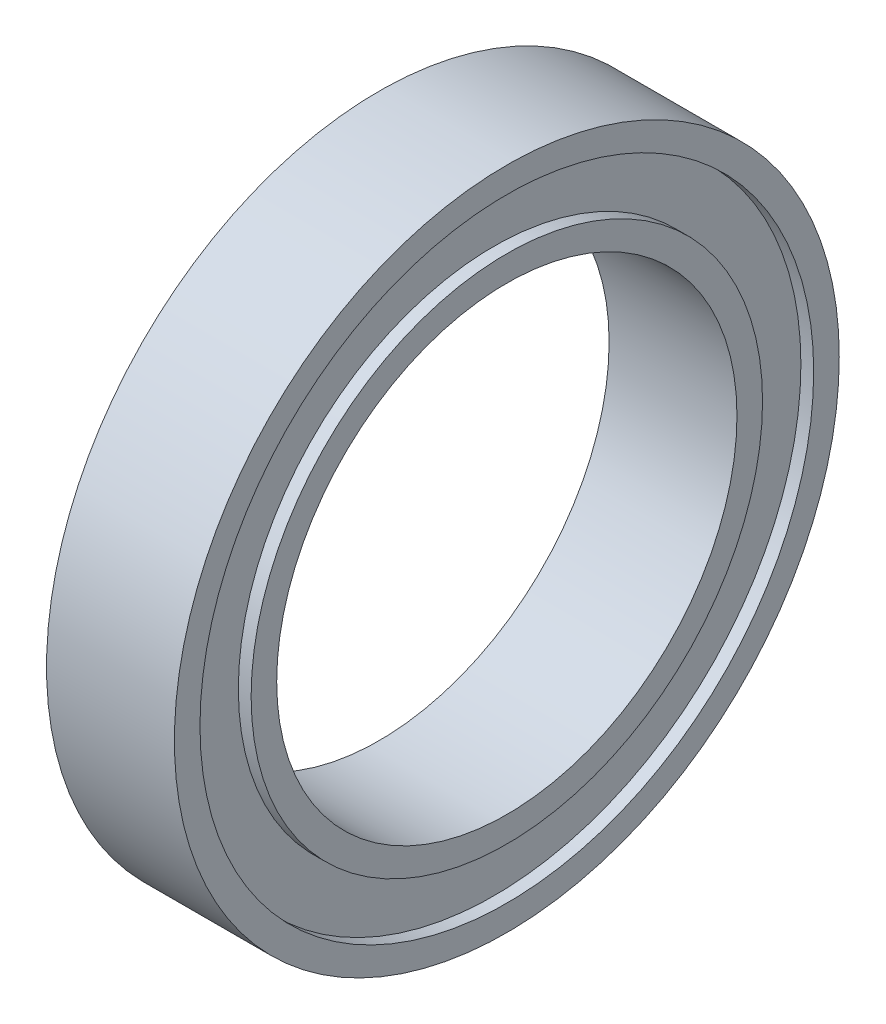
ISO-10303-21;
HEADER;
FILE_DESCRIPTION(('STEP AP214'),'2;1');
FILE_NAME('part.step','',(''),(''),'','','');
FILE_SCHEMA(('AUTOMOTIVE_DESIGN { 1 0 10303 214 1 1 1 1 }'));
ENDSEC;
DATA;
#1=APPLICATION_CONTEXT('core data for automotive mechanical design processes');
#2=APPLICATION_PROTOCOL_DEFINITION('international standard','automotive_design',2000,#1);
#3=PRODUCT_CONTEXT('',#1,'mechanical');
#4=PRODUCT('Part','Part','',(#3));
#5=PRODUCT_RELATED_PRODUCT_CATEGORY('part','',(#4));
#6=PRODUCT_DEFINITION_FORMATION('','',#4);
#7=PRODUCT_DEFINITION_CONTEXT('part definition',#1,'design');
#8=PRODUCT_DEFINITION('design','',#6,#7);
#9=PRODUCT_DEFINITION_SHAPE('','',#8);
#10=(LENGTH_UNIT() NAMED_UNIT(*) SI_UNIT(.MILLI.,.METRE.));
#11=(NAMED_UNIT(*) PLANE_ANGLE_UNIT() SI_UNIT($,.RADIAN.));
#12=(NAMED_UNIT(*) SI_UNIT($,.STERADIAN.) SOLID_ANGLE_UNIT());
#13=UNCERTAINTY_MEASURE_WITH_UNIT(LENGTH_MEASURE(1.E-05),#10,'distance_accuracy_value','');
#14=(GEOMETRIC_REPRESENTATION_CONTEXT(3) GLOBAL_UNCERTAINTY_ASSIGNED_CONTEXT((#13)) GLOBAL_UNIT_ASSIGNED_CONTEXT((#10,
#11,#12)) REPRESENTATION_CONTEXT('',''));
#15=CARTESIAN_POINT('',(0.,0.,0.));
#16=DIRECTION('',(0.,0.,1.));
#17=DIRECTION('',(1.,0.,0.));
#18=AXIS2_PLACEMENT_3D('',#15,#16,#17);
#19=CARTESIAN_POINT('',(-2.5,0.,0.));
#20=DIRECTION('',(1.,0.,0.));
#21=DIRECTION('',(0.,0.,-1.));
#22=AXIS2_PLACEMENT_3D('',#19,#20,#21);
#23=PLANE('',#22);
#24=CARTESIAN_POINT('',(-2.5,0.,0.));
#25=DIRECTION('',(1.,0.,0.));
#26=DIRECTION('',(0.,0.,-1.));
#27=AXIS2_PLACEMENT_3D('',#24,#25,#26);
#28=CIRCLE('',#27,9.);
#29=CARTESIAN_POINT('',(-2.5,0.,-9.));
#30=VERTEX_POINT('',#29);
#31=EDGE_CURVE('E37',#30,#30,#28,.T.);
#32=ORIENTED_EDGE('',*,*,#31,.T.);
#33=EDGE_LOOP('',(#32));
#34=FACE_BOUND('',#33,.T.);
#35=CARTESIAN_POINT('',(-2.5,0.,0.));
#36=DIRECTION('',(1.,0.,0.));
#37=DIRECTION('',(0.,0.,-1.));
#38=AXIS2_PLACEMENT_3D('',#35,#36,#37);
#39=CIRCLE('',#38,10.);
#40=CARTESIAN_POINT('',(-2.5,0.,-10.));
#41=VERTEX_POINT('',#40);
#42=EDGE_CURVE('E67',#41,#41,#39,.T.);
#43=ORIENTED_EDGE('',*,*,#42,.F.);
#44=EDGE_LOOP('',(#43));
#45=FACE_BOUND('',#44,.T.);
#46=ADVANCED_FACE('F33',(#34,#45),#23,.F.);
#47=CARTESIAN_POINT('',(2.5,0.,0.));
#48=DIRECTION('',(1.,0.,0.));
#49=DIRECTION('',(0.,0.,-1.));
#50=AXIS2_PLACEMENT_3D('',#47,#48,#49);
#51=PLANE('',#50);
#52=CARTESIAN_POINT('',(2.5,0.,0.));
#53=DIRECTION('',(1.,0.,0.));
#54=DIRECTION('',(0.,0.,-1.));
#55=AXIS2_PLACEMENT_3D('',#52,#53,#54);
#56=CIRCLE('',#55,9.);
#57=CARTESIAN_POINT('',(2.5,0.,-9.));
#58=VERTEX_POINT('',#57);
#59=EDGE_CURVE('E47',#58,#58,#56,.T.);
#60=ORIENTED_EDGE('',*,*,#59,.F.);
#61=EDGE_LOOP('',(#60));
#62=FACE_BOUND('',#61,.T.);
#63=CARTESIAN_POINT('',(2.5,0.,0.));
#64=DIRECTION('',(1.,0.,0.));
#65=DIRECTION('',(0.,0.,-1.));
#66=AXIS2_PLACEMENT_3D('',#63,#64,#65);
#67=CIRCLE('',#66,10.);
#68=CARTESIAN_POINT('',(2.5,0.,-10.));
#69=VERTEX_POINT('',#68);
#70=EDGE_CURVE('E55',#69,#69,#67,.T.);
#71=ORIENTED_EDGE('',*,*,#70,.T.);
#72=EDGE_LOOP('',(#71));
#73=FACE_BOUND('',#72,.T.);
#74=ADVANCED_FACE('F87',(#62,#73),#51,.T.);
#75=CARTESIAN_POINT('',(2.5,0.,0.));
#76=DIRECTION('',(-1.,0.,0.));
#77=DIRECTION('',(0.,0.,1.));
#78=AXIS2_PLACEMENT_3D('',#75,#76,#77);
#79=CYLINDRICAL_SURFACE('',#78,13.);
#80=CARTESIAN_POINT('',(2.5,0.,0.));
#81=DIRECTION('',(1.,0.,0.));
#82=DIRECTION('',(0.,0.,-1.));
#83=AXIS2_PLACEMENT_3D('',#80,#81,#82);
#84=CIRCLE('',#83,13.);
#85=CARTESIAN_POINT('',(2.5,0.,-13.));
#86=VERTEX_POINT('',#85);
#87=EDGE_CURVE('E10',#86,#86,#84,.T.);
#88=ORIENTED_EDGE('',*,*,#87,.F.);
#89=EDGE_LOOP('',(#88));
#90=FACE_BOUND('',#89,.T.);
#91=CARTESIAN_POINT('',(-2.5,0.,0.));
#92=DIRECTION('',(1.,0.,0.));
#93=DIRECTION('',(0.,0.,-1.));
#94=AXIS2_PLACEMENT_3D('',#91,#92,#93);
#95=CIRCLE('',#94,13.);
#96=CARTESIAN_POINT('',(-2.5,0.,-13.));
#97=VERTEX_POINT('',#96);
#98=EDGE_CURVE('E41',#97,#97,#95,.T.);
#99=ORIENTED_EDGE('',*,*,#98,.T.);
#100=EDGE_LOOP('',(#99));
#101=FACE_BOUND('',#100,.T.);
#102=ADVANCED_FACE('F35',(#90,#101),#79,.T.);
#103=CARTESIAN_POINT('',(2.5,0.,0.));
#104=DIRECTION('',(1.,0.,0.));
#105=DIRECTION('',(0.,0.,-1.));
#106=AXIS2_PLACEMENT_3D('',#103,#104,#105);
#107=CIRCLE('',#106,12.);
#108=CARTESIAN_POINT('',(2.5,0.,-12.));
#109=VERTEX_POINT('',#108);
#110=EDGE_CURVE('E51',#109,#109,#107,.T.);
#111=ORIENTED_EDGE('',*,*,#110,.F.);
#112=EDGE_LOOP('',(#111));
#113=FACE_BOUND('',#112,.T.);
#114=ORIENTED_EDGE('',*,*,#87,.T.);
#115=EDGE_LOOP('',(#114));
#116=FACE_BOUND('',#115,.T.);
#117=ADVANCED_FACE('F95',(#113,#116),#51,.T.);
#118=CARTESIAN_POINT('',(-2.5,0.,0.));
#119=DIRECTION('',(1.,0.,0.));
#120=DIRECTION('',(0.,0.,-1.));
#121=AXIS2_PLACEMENT_3D('',#118,#119,#120);
#122=CIRCLE('',#121,12.);
#123=CARTESIAN_POINT('',(-2.5,0.,-12.));
#124=VERTEX_POINT('',#123);
#125=EDGE_CURVE('E63',#124,#124,#122,.T.);
#126=ORIENTED_EDGE('',*,*,#125,.T.);
#127=EDGE_LOOP('',(#126));
#128=FACE_BOUND('',#127,.T.);
#129=ORIENTED_EDGE('',*,*,#98,.F.);
#130=EDGE_LOOP('',(#129));
#131=FACE_BOUND('',#130,.T.);
#132=ADVANCED_FACE('F89',(#128,#131),#23,.F.);
#133=CARTESIAN_POINT('',(-3.5,0.,0.));
#134=DIRECTION('',(1.,0.,0.));
#135=DIRECTION('',(0.,0.,-1.));
#136=AXIS2_PLACEMENT_3D('',#133,#134,#135);
#137=CYLINDRICAL_SURFACE('',#136,9.);
#138=ORIENTED_EDGE('',*,*,#59,.T.);
#139=EDGE_LOOP('',(#138));
#140=FACE_BOUND('',#139,.T.);
#141=ORIENTED_EDGE('',*,*,#31,.F.);
#142=EDGE_LOOP('',(#141));
#143=FACE_BOUND('',#142,.T.);
#144=ADVANCED_FACE('F98',(#140,#143),#137,.F.);
#145=CARTESIAN_POINT('',(2.,0.,0.));
#146=DIRECTION('',(1.,0.,0.));
#147=DIRECTION('',(0.,0.,-1.));
#148=AXIS2_PLACEMENT_3D('',#145,#146,#147);
#149=CYLINDRICAL_SURFACE('',#148,10.);
#150=CARTESIAN_POINT('',(2.,0.,0.));
#151=DIRECTION('',(1.,0.,0.));
#152=DIRECTION('',(0.,0.,-1.));
#153=AXIS2_PLACEMENT_3D('',#150,#151,#152);
#154=CIRCLE('',#153,10.);
#155=CARTESIAN_POINT('',(2.,0.,-10.));
#156=VERTEX_POINT('',#155);
#157=EDGE_CURVE('E54',#156,#156,#154,.T.);
#158=ORIENTED_EDGE('',*,*,#157,.T.);
#159=EDGE_LOOP('',(#158));
#160=FACE_BOUND('',#159,.T.);
#161=ORIENTED_EDGE('',*,*,#70,.F.);
#162=EDGE_LOOP('',(#161));
#163=FACE_BOUND('',#162,.T.);
#164=ADVANCED_FACE('F104',(#160,#163),#149,.T.);
#165=CARTESIAN_POINT('',(2.,0.,0.));
#166=DIRECTION('',(1.,0.,0.));
#167=DIRECTION('',(0.,0.,-1.));
#168=AXIS2_PLACEMENT_3D('',#165,#166,#167);
#169=CYLINDRICAL_SURFACE('',#168,12.);
#170=CARTESIAN_POINT('',(2.,0.,0.));
#171=DIRECTION('',(1.,0.,0.));
#172=DIRECTION('',(0.,0.,-1.));
#173=AXIS2_PLACEMENT_3D('',#170,#171,#172);
#174=CIRCLE('',#173,12.);
#175=CARTESIAN_POINT('',(2.,0.,-12.));
#176=VERTEX_POINT('',#175);
#177=EDGE_CURVE('E50',#176,#176,#174,.T.);
#178=ORIENTED_EDGE('',*,*,#177,.F.);
#179=EDGE_LOOP('',(#178));
#180=FACE_BOUND('',#179,.T.);
#181=ORIENTED_EDGE('',*,*,#110,.T.);
#182=EDGE_LOOP('',(#181));
#183=FACE_BOUND('',#182,.T.);
#184=ADVANCED_FACE('F184',(#180,#183),#169,.F.);
#185=CARTESIAN_POINT('',(2.,0.,0.));
#186=DIRECTION('',(1.,0.,0.));
#187=DIRECTION('',(0.,0.,-1.));
#188=AXIS2_PLACEMENT_3D('',#185,#186,#187);
#189=PLANE('',#188);
#190=ORIENTED_EDGE('',*,*,#157,.F.);
#191=EDGE_LOOP('',(#190));
#192=FACE_BOUND('',#191,.T.);
#193=ORIENTED_EDGE('',*,*,#177,.T.);
#194=EDGE_LOOP('',(#193));
#195=FACE_BOUND('',#194,.T.);
#196=ADVANCED_FACE('F82',(#192,#195),#189,.T.);
#197=CARTESIAN_POINT('',(-2.,0.,0.));
#198=DIRECTION('',(-1.,0.,0.));
#199=DIRECTION('',(0.,0.,1.));
#200=AXIS2_PLACEMENT_3D('',#197,#198,#199);
#201=CYLINDRICAL_SURFACE('',#200,10.);
#202=CARTESIAN_POINT('',(-2.,0.,0.));
#203=DIRECTION('',(1.,0.,0.));
#204=DIRECTION('',(0.,0.,-1.));
#205=AXIS2_PLACEMENT_3D('',#202,#203,#204);
#206=CIRCLE('',#205,10.);
#207=CARTESIAN_POINT('',(-2.,0.,-10.));
#208=VERTEX_POINT('',#207);
#209=EDGE_CURVE('E66',#208,#208,#206,.T.);
#210=ORIENTED_EDGE('',*,*,#209,.F.);
#211=EDGE_LOOP('',(#210));
#212=FACE_BOUND('',#211,.T.);
#213=ORIENTED_EDGE('',*,*,#42,.T.);
#214=EDGE_LOOP('',(#213));
#215=FACE_BOUND('',#214,.T.);
#216=ADVANCED_FACE('F78',(#212,#215),#201,.T.);
#217=CARTESIAN_POINT('',(-2.,0.,0.));
#218=DIRECTION('',(-1.,0.,0.));
#219=DIRECTION('',(0.,0.,1.));
#220=AXIS2_PLACEMENT_3D('',#217,#218,#219);
#221=CYLINDRICAL_SURFACE('',#220,12.);
#222=CARTESIAN_POINT('',(-2.,0.,0.));
#223=DIRECTION('',(1.,0.,0.));
#224=DIRECTION('',(0.,0.,-1.));
#225=AXIS2_PLACEMENT_3D('',#222,#223,#224);
#226=CIRCLE('',#225,12.);
#227=CARTESIAN_POINT('',(-2.,0.,-12.));
#228=VERTEX_POINT('',#227);
#229=EDGE_CURVE('E58',#228,#228,#226,.T.);
#230=ORIENTED_EDGE('',*,*,#229,.T.);
#231=EDGE_LOOP('',(#230));
#232=FACE_BOUND('',#231,.T.);
#233=ORIENTED_EDGE('',*,*,#125,.F.);
#234=EDGE_LOOP('',(#233));
#235=FACE_BOUND('',#234,.T.);
#236=ADVANCED_FACE('F81',(#232,#235),#221,.F.);
#237=CARTESIAN_POINT('',(-2.,0.,0.));
#238=DIRECTION('',(-1.,0.,0.));
#239=DIRECTION('',(0.,0.,-1.));
#240=AXIS2_PLACEMENT_3D('',#237,#238,#239);
#241=PLANE('',#240);
#242=ORIENTED_EDGE('',*,*,#209,.T.);
#243=EDGE_LOOP('',(#242));
#244=FACE_BOUND('',#243,.T.);
#245=ORIENTED_EDGE('',*,*,#229,.F.);
#246=EDGE_LOOP('',(#245));
#247=FACE_BOUND('',#246,.T.);
#248=ADVANCED_FACE('F75',(#244,#247),#241,.T.);
#249=CLOSED_SHELL('',(#46,#74,#102,#117,#132,#144,#164,#184,#196,#216,#236,#248));
#250=MANIFOLD_SOLID_BREP('B2',#249);
#251=ADVANCED_BREP_SHAPE_REPRESENTATION('',(#18,#250),#14);
#252=SHAPE_DEFINITION_REPRESENTATION(#9,#251);
ENDSEC;
END-ISO-10303-21;
